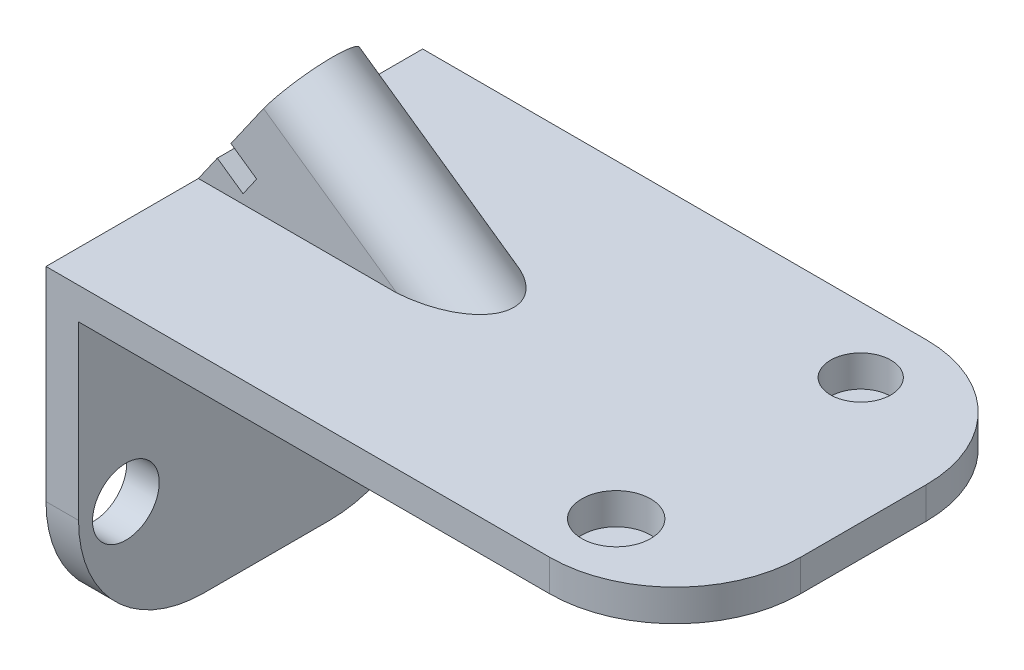
ISO-10303-21;
HEADER;
FILE_DESCRIPTION(('STEP AP214'),'2;1');
FILE_NAME('part.step','',(''),(''),'','','');
FILE_SCHEMA(('AUTOMOTIVE_DESIGN { 1 0 10303 214 1 1 1 1 }'));
ENDSEC;
DATA;
#1=APPLICATION_CONTEXT('core data for automotive mechanical design processes');
#2=APPLICATION_PROTOCOL_DEFINITION('international standard','automotive_design',2000,#1);
#3=PRODUCT_CONTEXT('',#1,'mechanical');
#4=PRODUCT('Part','Part','',(#3));
#5=PRODUCT_RELATED_PRODUCT_CATEGORY('part','',(#4));
#6=PRODUCT_DEFINITION_FORMATION('','',#4);
#7=PRODUCT_DEFINITION_CONTEXT('part definition',#1,'design');
#8=PRODUCT_DEFINITION('design','',#6,#7);
#9=PRODUCT_DEFINITION_SHAPE('','',#8);
#10=(LENGTH_UNIT() NAMED_UNIT(*) SI_UNIT(.MILLI.,.METRE.));
#11=(NAMED_UNIT(*) PLANE_ANGLE_UNIT() SI_UNIT($,.RADIAN.));
#12=(NAMED_UNIT(*) SI_UNIT($,.STERADIAN.) SOLID_ANGLE_UNIT());
#13=UNCERTAINTY_MEASURE_WITH_UNIT(LENGTH_MEASURE(1.E-05),#10,'distance_accuracy_value','');
#14=(GEOMETRIC_REPRESENTATION_CONTEXT(3) GLOBAL_UNCERTAINTY_ASSIGNED_CONTEXT((#13)) GLOBAL_UNIT_ASSIGNED_CONTEXT((#10,
#11,#12)) REPRESENTATION_CONTEXT('',''));
#15=CARTESIAN_POINT('',(0.,0.,0.));
#16=DIRECTION('',(0.,0.,1.));
#17=DIRECTION('',(1.,0.,0.));
#18=AXIS2_PLACEMENT_3D('',#15,#16,#17);
#19=CARTESIAN_POINT('',(-38.9542038600132,27.2362726175702,-50.));
#20=DIRECTION('',(-0.819544823722907,0.573015080001382,0.));
#21=DIRECTION('',(-0.573015080001382,-0.819544823722907,0.));
#22=AXIS2_PLACEMENT_3D('',#19,#20,#21);
#23=PLANE('',#22);
#24=CARTESIAN_POINT('',(-31.2198983618123,38.2981281556948,-23.1969128920143));
#25=DIRECTION('',(-0.819544823722907,0.573015080001382,0.));
#26=DIRECTION('',(-0.573015080001382,-0.819544823722907,0.));
#27=AXIS2_PLACEMENT_3D('',#24,#25,#26);
#28=CIRCLE('',#27,6.13363539103106);
#29=CARTESIAN_POINT('',(-34.7345639361033,33.2713390203717,-23.1969128920143));
#30=VERTEX_POINT('',#29);
#31=EDGE_CURVE('E371',#30,#30,#28,.T.);
#32=ORIENTED_EDGE('',*,*,#31,.F.);
#33=EDGE_LOOP('',(#32));
#34=FACE_BOUND('',#33,.T.);
#35=DIRECTION('',(0.,0.,-1.));
#36=VECTOR('',#35,1.);
#37=CARTESIAN_POINT('',(-40.5606897132775,24.9386242460411,-37.8469956443982));
#38=LINE('',#37,#36);
#39=CARTESIAN_POINT('',(-40.5606897132775,24.9386242460411,-8.54683013963037));
#40=VERTEX_POINT('',#39);
#41=CARTESIAN_POINT('',(-40.5606897132775,24.9386242460411,-37.8469956443982));
#42=VERTEX_POINT('',#41);
#43=EDGE_CURVE('E188',#40,#42,#38,.T.);
#44=ORIENTED_EDGE('',*,*,#43,.F.);
#45=DIRECTION('',(-0.573015080001382,-0.819544823722907,0.));
#46=VECTOR('',#45,1.);
#47=CARTESIAN_POINT('',(-38.9542038600132,27.2362726175702,-8.54683013963037));
#48=LINE('',#47,#46);
#49=CARTESIAN_POINT('',(-30.182865196379,39.781326752768,-8.54683013963037));
#50=VERTEX_POINT('',#49);
#51=EDGE_CURVE('E259',#50,#40,#48,.T.);
#52=ORIENTED_EDGE('',*,*,#51,.F.);
#53=CARTESIAN_POINT('',(-31.2198983618123,38.2981281556948,-23.1969128920143));
#54=DIRECTION('',(-0.819544823722907,0.573015080001382,0.));
#55=DIRECTION('',(-0.573015080001382,-0.819544823722907,0.));
#56=AXIS2_PLACEMENT_3D('',#53,#54,#55);
#57=CIRCLE('',#56,14.7614443912601);
#58=CARTESIAN_POINT('',(-30.182865196379,39.781326752768,-37.8469956443982));
#59=VERTEX_POINT('',#58);
#60=EDGE_CURVE('E255',#59,#50,#57,.F.);
#61=ORIENTED_EDGE('',*,*,#60,.F.);
#62=DIRECTION('',(-0.573015080001382,-0.819544823722907,0.));
#63=VECTOR('',#62,1.);
#64=CARTESIAN_POINT('',(-38.9542038600132,27.2362726175702,-37.8469956443982));
#65=LINE('',#64,#63);
#66=EDGE_CURVE('E263',#59,#42,#65,.T.);
#67=ORIENTED_EDGE('',*,*,#66,.T.);
#68=EDGE_LOOP('',(#44,#52,#61,#67));
#69=FACE_BOUND('',#68,.T.);
#70=ADVANCED_FACE('F41',(#34,#69),#23,.T.);
#71=DIRECTION('',(0.,0.,1.));
#72=VECTOR('',#71,1.);
#73=CARTESIAN_POINT('',(-44.9050178383504,18.7252247183206,-37.8469956443982));
#74=LINE('',#73,#72);
#75=CARTESIAN_POINT('',(-44.9050178383504,18.7252247183206,-37.8469956443982));
#76=VERTEX_POINT('',#75);
#77=CARTESIAN_POINT('',(-44.9050178383504,18.7252247183206,-8.54683013963037));
#78=VERTEX_POINT('',#77);
#79=EDGE_CURVE('E356',#76,#78,#74,.T.);
#80=ORIENTED_EDGE('',*,*,#79,.F.);
#81=CARTESIAN_POINT('',(-50.938514230176,10.0959217393142,-37.8469956443982));
#82=VERTEX_POINT('',#81);
#83=EDGE_CURVE('E193',#76,#82,#65,.T.);
#84=ORIENTED_EDGE('',*,*,#83,.T.);
#85=DIRECTION('',(0.,0.,1.));
#86=VECTOR('',#85,1.);
#87=CARTESIAN_POINT('',(-50.938514230176,10.0959217393142,-50.));
#88=LINE('',#87,#86);
#89=CARTESIAN_POINT('',(-50.938514230176,10.0959217393142,-8.54683013963037));
#90=VERTEX_POINT('',#89);
#91=EDGE_CURVE('E285',#82,#90,#88,.T.);
#92=ORIENTED_EDGE('',*,*,#91,.T.);
#93=EDGE_CURVE('E258',#78,#90,#48,.T.);
#94=ORIENTED_EDGE('',*,*,#93,.F.);
#95=EDGE_LOOP('',(#80,#84,#92,#94));
#96=FACE_BOUND('',#95,.T.);
#97=ADVANCED_FACE('F412',(#96),#23,.T.);
#98=CARTESIAN_POINT('',(50.7345840104783,-19.0033798444434,-23.1969128920143));
#99=DIRECTION('',(-0.819544823722906,0.573015080001382,0.));
#100=DIRECTION('',(-0.573015080001382,-0.819544823722907,0.));
#101=AXIS2_PLACEMENT_3D('',#98,#99,#100);
#102=CYLINDRICAL_SURFACE('',#101,14.7614443912601);
#103=DIRECTION('',(-0.819544823722906,0.573015080001382,0.));
#104=VECTOR('',#103,1.);
#105=CARTESIAN_POINT('',(51.7716171759116,-17.5201812473702,-37.8469956443982));
#106=LINE('',#105,#104);
#107=CARTESIAN_POINT('',(12.2741675554212,10.0959217393142,-37.8469956443982));
#108=VERTEX_POINT('',#107);
#109=EDGE_CURVE('E268',#108,#59,#106,.T.);
#110=ORIENTED_EDGE('',*,*,#109,.T.);
#111=ORIENTED_EDGE('',*,*,#60,.T.);
#112=DIRECTION('',(-0.819544823722906,0.573015080001382,0.));
#113=VECTOR('',#112,1.);
#114=CARTESIAN_POINT('',(51.7716171759116,-17.5201812473702,-8.54683013963037));
#115=LINE('',#114,#113);
#116=CARTESIAN_POINT('',(12.2741675554212,10.0959217393142,-8.54683013963037));
#117=VERTEX_POINT('',#116);
#118=EDGE_CURVE('E267',#117,#50,#115,.T.);
#119=ORIENTED_EDGE('',*,*,#118,.F.);
#120=CARTESIAN_POINT('',(9.11581546626697,10.0959217393142,-23.1969128920143));
#121=DIRECTION('',(0.,1.,0.));
#122=DIRECTION('',(-1.,0.,0.));
#123=AXIS2_PLACEMENT_3D('',#120,#121,#122);
#124=ELLIPSE('',#123,25.7610050877274,14.7614443912601);
#125=EDGE_CURVE('E281',#108,#117,#124,.F.);
#126=ORIENTED_EDGE('',*,*,#125,.F.);
#127=EDGE_LOOP('',(#110,#111,#119,#126));
#128=FACE_BOUND('',#127,.T.);
#129=ADVANCED_FACE('F396',(#128),#102,.T.);
#130=CARTESIAN_POINT('',(43.0002785122774,-30.0652353825679,-37.8469956443982));
#131=DIRECTION('',(0.,0.,-1.));
#132=DIRECTION('',(-1.,0.,0.));
#133=AXIS2_PLACEMENT_3D('',#130,#131,#132);
#134=PLANE('',#133);
#135=DIRECTION('',(-0.819544823722906,0.573015080001382,0.));
#136=VECTOR('',#135,1.);
#137=CARTESIAN_POINT('',(-32.3652414760485,19.2084734460272,-37.8469956443982));
#138=LINE('',#137,#136);
#139=CARTESIAN_POINT('',(-32.3652414760485,19.2084734460272,-37.8469956443982));
#140=VERTEX_POINT('',#139);
#141=EDGE_CURVE('E374',#140,#42,#138,.T.);
#142=ORIENTED_EDGE('',*,*,#141,.T.);
#143=ORIENTED_EDGE('',*,*,#66,.F.);
#144=ORIENTED_EDGE('',*,*,#109,.F.);
#145=DIRECTION('',(-1.,0.,0.));
#146=VECTOR('',#145,1.);
#147=CARTESIAN_POINT('',(0.,10.0959217393142,-37.8469956443982));
#148=LINE('',#147,#146);
#149=EDGE_CURVE('E278',#108,#82,#148,.T.);
#150=ORIENTED_EDGE('',*,*,#149,.T.);
#151=ORIENTED_EDGE('',*,*,#83,.F.);
#152=DIRECTION('',(-0.819544823722906,0.573015080001382,0.));
#153=VECTOR('',#152,1.);
#154=CARTESIAN_POINT('',(-36.7095696011213,12.9950739183068,-37.8469956443982));
#155=LINE('',#154,#153);
#156=CARTESIAN_POINT('',(-36.7095696011213,12.9950739183068,-37.8469956443982));
#157=VERTEX_POINT('',#156);
#158=EDGE_CURVE('E170',#157,#76,#155,.T.);
#159=ORIENTED_EDGE('',*,*,#158,.F.);
#160=DIRECTION('',(-0.573015080001382,-0.819544823722907,0.));
#161=VECTOR('',#160,1.);
#162=CARTESIAN_POINT('',(-32.3652414760485,19.2084734460272,-37.8469956443982));
#163=LINE('',#162,#161);
#164=EDGE_CURVE('E178',#140,#157,#163,.T.);
#165=ORIENTED_EDGE('',*,*,#164,.F.);
#166=EDGE_LOOP('',(#142,#143,#144,#150,#151,#159,#165));
#167=FACE_BOUND('',#166,.T.);
#168=ADVANCED_FACE('F191',(#167),#134,.T.);
#169=CARTESIAN_POINT('',(43.0002785122774,-30.0652353825679,-8.54683013963037));
#170=DIRECTION('',(0.,0.,-1.));
#171=DIRECTION('',(0.,1.,0.));
#172=AXIS2_PLACEMENT_3D('',#169,#170,#171);
#173=PLANE('',#172);
#174=ORIENTED_EDGE('',*,*,#51,.T.);
#175=DIRECTION('',(-0.819544823722906,0.573015080001382,0.));
#176=VECTOR('',#175,1.);
#177=CARTESIAN_POINT('',(-32.3652414760485,19.2084734460272,-8.54683013963037));
#178=LINE('',#177,#176);
#179=CARTESIAN_POINT('',(-32.3652414760485,19.2084734460272,-8.54683013963037));
#180=VERTEX_POINT('',#179);
#181=EDGE_CURVE('E198',#180,#40,#178,.T.);
#182=ORIENTED_EDGE('',*,*,#181,.F.);
#183=DIRECTION('',(0.573015080001382,0.819544823722907,0.));
#184=VECTOR('',#183,1.);
#185=CARTESIAN_POINT('',(-32.3652414760485,19.2084734460272,-8.54683013963037));
#186=LINE('',#185,#184);
#187=CARTESIAN_POINT('',(-36.7095696011214,12.9950739183068,-8.54683013963037));
#188=VERTEX_POINT('',#187);
#189=EDGE_CURVE('E177',#188,#180,#186,.T.);
#190=ORIENTED_EDGE('',*,*,#189,.F.);
#191=DIRECTION('',(-0.819544823722906,0.573015080001382,0.));
#192=VECTOR('',#191,1.);
#193=CARTESIAN_POINT('',(-36.7095696011213,12.9950739183068,-8.54683013963037));
#194=LINE('',#193,#192);
#195=EDGE_CURVE('E173',#188,#78,#194,.T.);
#196=ORIENTED_EDGE('',*,*,#195,.T.);
#197=ORIENTED_EDGE('',*,*,#93,.T.);
#198=DIRECTION('',(-1.,0.,0.));
#199=VECTOR('',#198,1.);
#200=CARTESIAN_POINT('',(0.,10.0959217393142,-8.54683013963037));
#201=LINE('',#200,#199);
#202=EDGE_CURVE('E271',#117,#90,#201,.T.);
#203=ORIENTED_EDGE('',*,*,#202,.F.);
#204=ORIENTED_EDGE('',*,*,#118,.T.);
#205=EDGE_LOOP('',(#174,#182,#190,#196,#197,#203,#204));
#206=FACE_BOUND('',#205,.T.);
#207=ADVANCED_FACE('F393',(#206),#173,.F.);
#208=CARTESIAN_POINT('',(149.486050834949,0.,40.));
#209=DIRECTION('',(-1.,0.,0.));
#210=DIRECTION('',(0.,0.,1.));
#211=AXIS2_PLACEMENT_3D('',#208,#209,#210);
#212=PLANE('',#211);
#213=DIRECTION('',(0.,0.,-1.));
#214=VECTOR('',#213,1.);
#215=CARTESIAN_POINT('',(149.486050834949,0.,40.));
#216=LINE('',#215,#214);
#217=CARTESIAN_POINT('',(149.486050834949,0.,0.));
#218=VERTEX_POINT('',#217);
#219=CARTESIAN_POINT('',(149.486050834949,0.,-40.));
#220=VERTEX_POINT('',#219);
#221=EDGE_CURVE('E230',#218,#220,#216,.T.);
#222=ORIENTED_EDGE('',*,*,#221,.T.);
#223=DIRECTION('',(0.,1.,0.));
#224=VECTOR('',#223,1.);
#225=CARTESIAN_POINT('',(149.486050834949,0.,-40.));
#226=LINE('',#225,#224);
#227=CARTESIAN_POINT('',(149.486050834949,10.0959217393142,-40.));
#228=VERTEX_POINT('',#227);
#229=EDGE_CURVE('E318',#220,#228,#226,.T.);
#230=ORIENTED_EDGE('',*,*,#229,.T.);
#231=DIRECTION('',(0.,0.,-1.));
#232=VECTOR('',#231,1.);
#233=CARTESIAN_POINT('',(149.486050834949,10.0959217393142,40.));
#234=LINE('',#233,#232);
#235=CARTESIAN_POINT('',(149.486050834949,10.0959217393142,0.));
#236=VERTEX_POINT('',#235);
#237=EDGE_CURVE('E251',#236,#228,#234,.T.);
#238=ORIENTED_EDGE('',*,*,#237,.F.);
#239=DIRECTION('',(0.,1.,0.));
#240=VECTOR('',#239,1.);
#241=CARTESIAN_POINT('',(149.486050834949,0.,0.));
#242=LINE('',#241,#240);
#243=EDGE_CURVE('E315',#236,#218,#242,.F.);
#244=ORIENTED_EDGE('',*,*,#243,.T.);
#245=EDGE_LOOP('',(#222,#230,#238,#244));
#246=FACE_BOUND('',#245,.T.);
#247=ADVANCED_FACE('F445',(#246),#212,.F.);
#248=CARTESIAN_POINT('',(149.486050834949,10.0959217393142,40.));
#249=DIRECTION('',(0.,-1.,0.));
#250=DIRECTION('',(1.,0.,0.));
#251=AXIS2_PLACEMENT_3D('',#248,#249,#250);
#252=PLANE('',#251);
#253=CARTESIAN_POINT('',(109.486050834949,10.0959217393142,-59.1371422561504));
#254=DIRECTION('',(0.,1.,0.));
#255=DIRECTION('',(-1.,0.,0.));
#256=AXIS2_PLACEMENT_3D('',#253,#254,#255);
#257=CIRCLE('',#256,9.61262759646853);
#258=CARTESIAN_POINT('',(99.8734232384804,10.0959217393142,-59.1371422561504));
#259=VERTEX_POINT('',#258);
#260=EDGE_CURVE('E357',#259,#259,#257,.T.);
#261=ORIENTED_EDGE('',*,*,#260,.F.);
#262=EDGE_LOOP('',(#261));
#263=FACE_BOUND('',#262,.T.);
#264=CARTESIAN_POINT('',(109.486050834949,10.0959217393142,18.771374571513));
#265=DIRECTION('',(0.,1.,0.));
#266=DIRECTION('',(-1.,0.,0.));
#267=AXIS2_PLACEMENT_3D('',#264,#265,#266);
#268=CIRCLE('',#267,10.9785923391769);
#269=CARTESIAN_POINT('',(98.5074584957721,10.0959217393142,18.771374571513));
#270=VERTEX_POINT('',#269);
#271=EDGE_CURVE('E342',#270,#270,#268,.T.);
#272=ORIENTED_EDGE('',*,*,#271,.F.);
#273=EDGE_LOOP('',(#272));
#274=FACE_BOUND('',#273,.T.);
#275=ORIENTED_EDGE('',*,*,#237,.T.);
#276=CARTESIAN_POINT('',(109.486050834949,10.0959217393142,-40.));
#277=DIRECTION('',(0.,-1.,0.));
#278=DIRECTION('',(1.,0.,0.));
#279=AXIS2_PLACEMENT_3D('',#276,#277,#278);
#280=CIRCLE('',#279,40.);
#281=CARTESIAN_POINT('',(109.486050834949,10.0959217393142,-80.));
#282=VERTEX_POINT('',#281);
#283=EDGE_CURVE('E325',#228,#282,#280,.F.);
#284=ORIENTED_EDGE('',*,*,#283,.T.);
#285=DIRECTION('',(-1.,0.,0.));
#286=VECTOR('',#285,1.);
#287=CARTESIAN_POINT('',(149.486050834949,10.0959217393142,-80.));
#288=LINE('',#287,#286);
#289=CARTESIAN_POINT('',(-50.938514230176,10.0959217393142,-80.));
#290=VERTEX_POINT('',#289);
#291=EDGE_CURVE('E203',#282,#290,#288,.T.);
#292=ORIENTED_EDGE('',*,*,#291,.T.);
#293=DIRECTION('',(0.,0.,-1.));
#294=VECTOR('',#293,1.);
#295=CARTESIAN_POINT('',(-50.938514230176,10.0959217393142,40.));
#296=LINE('',#295,#294);
#297=EDGE_CURVE('E246',#82,#290,#296,.T.);
#298=ORIENTED_EDGE('',*,*,#297,.F.);
#299=ORIENTED_EDGE('',*,*,#149,.F.);
#300=ORIENTED_EDGE('',*,*,#125,.T.);
#301=ORIENTED_EDGE('',*,*,#202,.T.);
#302=CARTESIAN_POINT('',(-50.938514230176,10.0959217393142,40.));
#303=VERTEX_POINT('',#302);
#304=EDGE_CURVE('E247',#303,#90,#296,.T.);
#305=ORIENTED_EDGE('',*,*,#304,.F.);
#306=DIRECTION('',(-1.,0.,0.));
#307=VECTOR('',#306,1.);
#308=CARTESIAN_POINT('',(149.486050834949,10.0959217393142,40.));
#309=LINE('',#308,#307);
#310=CARTESIAN_POINT('',(109.486050834949,10.0959217393142,40.));
#311=VERTEX_POINT('',#310);
#312=EDGE_CURVE('E217',#311,#303,#309,.T.);
#313=ORIENTED_EDGE('',*,*,#312,.F.);
#314=CARTESIAN_POINT('',(109.486050834949,10.0959217393142,0.));
#315=DIRECTION('',(0.,-1.,0.));
#316=DIRECTION('',(1.,0.,0.));
#317=AXIS2_PLACEMENT_3D('',#314,#315,#316);
#318=CIRCLE('',#317,40.);
#319=EDGE_CURVE('E322',#311,#236,#318,.F.);
#320=ORIENTED_EDGE('',*,*,#319,.T.);
#321=EDGE_LOOP('',(#275,#284,#292,#298,#299,#300,#301,#305,#313,#320));
#322=FACE_BOUND('',#321,.T.);
#323=ADVANCED_FACE('F400',(#263,#274,#322),#252,.F.);
#324=CARTESIAN_POINT('',(-50.938514230176,10.0959217393142,40.));
#325=DIRECTION('',(1.,0.,0.));
#326=DIRECTION('',(0.,0.,-1.));
#327=AXIS2_PLACEMENT_3D('',#324,#325,#326);
#328=PLANE('',#327);
#329=CARTESIAN_POINT('',(-50.938514230176,-57.1640659984027,-63.5436924796393));
#330=DIRECTION('',(-1.,0.,0.));
#331=DIRECTION('',(0.,0.,1.));
#332=AXIS2_PLACEMENT_3D('',#329,#330,#331);
#333=CIRCLE('',#332,10.6287753296757);
#334=CARTESIAN_POINT('',(-50.938514230176,-57.1640659984027,-52.9149171499635));
#335=VERTEX_POINT('',#334);
#336=EDGE_CURVE('E336',#335,#335,#333,.T.);
#337=ORIENTED_EDGE('',*,*,#336,.F.);
#338=EDGE_LOOP('',(#337));
#339=FACE_BOUND('',#338,.T.);
#340=CARTESIAN_POINT('',(-50.938514230176,-57.1640659984027,24.9151473608878));
#341=DIRECTION('',(-1.,0.,0.));
#342=DIRECTION('',(0.,0.,1.));
#343=AXIS2_PLACEMENT_3D('',#340,#341,#342);
#344=CIRCLE('',#343,10.6287753296757);
#345=CARTESIAN_POINT('',(-50.938514230176,-57.1640659984027,35.5439226905635));
#346=VERTEX_POINT('',#345);
#347=EDGE_CURVE('E344',#346,#346,#344,.T.);
#348=ORIENTED_EDGE('',*,*,#347,.F.);
#349=EDGE_LOOP('',(#348));
#350=FACE_BOUND('',#349,.T.);
#351=DIRECTION('',(0.,-1.,0.));
#352=VECTOR('',#351,1.);
#353=CARTESIAN_POINT('',(-50.938514230176,10.0959217393142,-80.));
#354=LINE('',#353,#352);
#355=CARTESIAN_POINT('',(-50.938514230176,-54.7797265503599,-80.));
#356=VERTEX_POINT('',#355);
#357=EDGE_CURVE('E206',#290,#356,#354,.T.);
#358=ORIENTED_EDGE('',*,*,#357,.T.);
#359=CARTESIAN_POINT('',(-50.938514230176,-54.7797265503599,-40.));
#360=DIRECTION('',(1.,0.,0.));
#361=DIRECTION('',(0.,0.,-1.));
#362=AXIS2_PLACEMENT_3D('',#359,#360,#361);
#363=CIRCLE('',#362,40.);
#364=CARTESIAN_POINT('',(-50.938514230176,-94.77972655036,-40.));
#365=VERTEX_POINT('',#364);
#366=EDGE_CURVE('E308',#356,#365,#363,.F.);
#367=ORIENTED_EDGE('',*,*,#366,.T.);
#368=DIRECTION('',(0.,0.,-1.));
#369=VECTOR('',#368,1.);
#370=CARTESIAN_POINT('',(-50.938514230176,-94.77972655036,40.));
#371=LINE('',#370,#369);
#372=CARTESIAN_POINT('',(-50.938514230176,-94.77972655036,0.));
#373=VERTEX_POINT('',#372);
#374=EDGE_CURVE('E242',#373,#365,#371,.T.);
#375=ORIENTED_EDGE('',*,*,#374,.F.);
#376=CARTESIAN_POINT('',(-50.938514230176,-54.7797265503599,0.));
#377=DIRECTION('',(1.,0.,0.));
#378=DIRECTION('',(0.,0.,-1.));
#379=AXIS2_PLACEMENT_3D('',#376,#377,#378);
#380=CIRCLE('',#379,40.);
#381=CARTESIAN_POINT('',(-50.938514230176,-54.7797265503599,40.));
#382=VERTEX_POINT('',#381);
#383=EDGE_CURVE('E305',#373,#382,#380,.F.);
#384=ORIENTED_EDGE('',*,*,#383,.T.);
#385=DIRECTION('',(0.,-1.,0.));
#386=VECTOR('',#385,1.);
#387=CARTESIAN_POINT('',(-50.938514230176,10.0959217393142,40.));
#388=LINE('',#387,#386);
#389=EDGE_CURVE('E220',#303,#382,#388,.T.);
#390=ORIENTED_EDGE('',*,*,#389,.F.);
#391=ORIENTED_EDGE('',*,*,#304,.T.);
#392=ORIENTED_EDGE('',*,*,#91,.F.);
#393=ORIENTED_EDGE('',*,*,#297,.T.);
#394=EDGE_LOOP('',(#358,#367,#375,#384,#390,#391,#392,#393));
#395=FACE_BOUND('',#394,.T.);
#396=ADVANCED_FACE('F408',(#339,#350,#395),#328,.F.);
#397=CARTESIAN_POINT('',(-50.938514230176,-94.77972655036,40.));
#398=DIRECTION('',(0.,1.,0.));
#399=DIRECTION('',(0.,0.,1.));
#400=AXIS2_PLACEMENT_3D('',#397,#398,#399);
#401=PLANE('',#400);
#402=ORIENTED_EDGE('',*,*,#374,.T.);
#403=DIRECTION('',(1.,0.,0.));
#404=VECTOR('',#403,1.);
#405=CARTESIAN_POINT('',(-50.938514230176,-94.77972655036,-40.));
#406=LINE('',#405,#404);
#407=CARTESIAN_POINT('',(-40.5773130530093,-94.77972655036,-40.));
#408=VERTEX_POINT('',#407);
#409=EDGE_CURVE('E292',#365,#408,#406,.T.);
#410=ORIENTED_EDGE('',*,*,#409,.T.);
#411=DIRECTION('',(0.,0.,-1.));
#412=VECTOR('',#411,1.);
#413=CARTESIAN_POINT('',(-40.5773130530093,-94.77972655036,40.));
#414=LINE('',#413,#412);
#415=CARTESIAN_POINT('',(-40.5773130530093,-94.77972655036,0.));
#416=VERTEX_POINT('',#415);
#417=EDGE_CURVE('E238',#416,#408,#414,.T.);
#418=ORIENTED_EDGE('',*,*,#417,.F.);
#419=DIRECTION('',(1.,0.,0.));
#420=VECTOR('',#419,1.);
#421=CARTESIAN_POINT('',(-50.938514230176,-94.77972655036,0.));
#422=LINE('',#421,#420);
#423=EDGE_CURVE('E289',#416,#373,#422,.F.);
#424=ORIENTED_EDGE('',*,*,#423,.T.);
#425=EDGE_LOOP('',(#402,#410,#418,#424));
#426=FACE_BOUND('',#425,.T.);
#427=ADVANCED_FACE('F462',(#426),#401,.F.);
#428=CARTESIAN_POINT('',(-40.5773130530093,-94.77972655036,40.));
#429=DIRECTION('',(-1.,0.,0.));
#430=DIRECTION('',(0.,0.,1.));
#431=AXIS2_PLACEMENT_3D('',#428,#429,#430);
#432=PLANE('',#431);
#433=CARTESIAN_POINT('',(-40.5773130530093,-57.1640659984027,-63.5436924796393));
#434=DIRECTION('',(-1.,0.,0.));
#435=DIRECTION('',(0.,0.,1.));
#436=AXIS2_PLACEMENT_3D('',#433,#434,#435);
#437=CIRCLE('',#436,10.6287753296757);
#438=CARTESIAN_POINT('',(-40.5773130530093,-57.1640659984027,-52.9149171499635));
#439=VERTEX_POINT('',#438);
#440=EDGE_CURVE('E45',#439,#439,#437,.T.);
#441=ORIENTED_EDGE('',*,*,#440,.T.);
#442=EDGE_LOOP('',(#441));
#443=FACE_BOUND('',#442,.T.);
#444=CARTESIAN_POINT('',(-40.5773130530093,-57.1640659984027,24.9151473608878));
#445=DIRECTION('',(-1.,0.,0.));
#446=DIRECTION('',(0.,0.,1.));
#447=AXIS2_PLACEMENT_3D('',#444,#445,#446);
#448=CIRCLE('',#447,10.6287753296757);
#449=CARTESIAN_POINT('',(-40.5773130530093,-57.1640659984027,35.5439226905635));
#450=VERTEX_POINT('',#449);
#451=EDGE_CURVE('E333',#450,#450,#448,.T.);
#452=ORIENTED_EDGE('',*,*,#451,.T.);
#453=EDGE_LOOP('',(#452));
#454=FACE_BOUND('',#453,.T.);
#455=ORIENTED_EDGE('',*,*,#417,.T.);
#456=CARTESIAN_POINT('',(-40.5773130530093,-54.7797265503599,-40.));
#457=DIRECTION('',(-1.,0.,0.));
#458=DIRECTION('',(0.,0.,1.));
#459=AXIS2_PLACEMENT_3D('',#456,#457,#458);
#460=CIRCLE('',#459,40.);
#461=CARTESIAN_POINT('',(-40.5773130530093,-54.77972655036,-80.));
#462=VERTEX_POINT('',#461);
#463=EDGE_CURVE('E299',#408,#462,#460,.F.);
#464=ORIENTED_EDGE('',*,*,#463,.T.);
#465=DIRECTION('',(0.,1.,0.));
#466=VECTOR('',#465,1.);
#467=CARTESIAN_POINT('',(-40.5773130530093,-94.77972655036,-80.));
#468=LINE('',#467,#466);
#469=CARTESIAN_POINT('',(-40.5773130530093,0.,-80.));
#470=VERTEX_POINT('',#469);
#471=EDGE_CURVE('E211',#462,#470,#468,.T.);
#472=ORIENTED_EDGE('',*,*,#471,.T.);
#473=DIRECTION('',(0.,0.,-1.));
#474=VECTOR('',#473,1.);
#475=CARTESIAN_POINT('',(-40.5773130530093,0.,40.));
#476=LINE('',#475,#474);
#477=CARTESIAN_POINT('',(-40.5773130530093,0.,40.));
#478=VERTEX_POINT('',#477);
#479=EDGE_CURVE('E234',#478,#470,#476,.T.);
#480=ORIENTED_EDGE('',*,*,#479,.F.);
#481=DIRECTION('',(0.,1.,0.));
#482=VECTOR('',#481,1.);
#483=CARTESIAN_POINT('',(-40.5773130530093,-94.77972655036,40.));
#484=LINE('',#483,#482);
#485=CARTESIAN_POINT('',(-40.5773130530093,-54.77972655036,40.));
#486=VERTEX_POINT('',#485);
#487=EDGE_CURVE('E224',#486,#478,#484,.T.);
#488=ORIENTED_EDGE('',*,*,#487,.F.);
#489=CARTESIAN_POINT('',(-40.5773130530093,-54.7797265503599,0.));
#490=DIRECTION('',(-1.,0.,0.));
#491=DIRECTION('',(0.,0.,1.));
#492=AXIS2_PLACEMENT_3D('',#489,#490,#491);
#493=CIRCLE('',#492,40.);
#494=EDGE_CURVE('E296',#486,#416,#493,.F.);
#495=ORIENTED_EDGE('',*,*,#494,.T.);
#496=EDGE_LOOP('',(#455,#464,#472,#480,#488,#495));
#497=FACE_BOUND('',#496,.T.);
#498=ADVANCED_FACE('F459',(#443,#454,#497),#432,.F.);
#499=CARTESIAN_POINT('',(-40.5773130530093,0.,40.));
#500=DIRECTION('',(0.,1.,0.));
#501=DIRECTION('',(0.,0.,1.));
#502=AXIS2_PLACEMENT_3D('',#499,#500,#501);
#503=PLANE('',#502);
#504=DIRECTION('',(1.,0.,0.));
#505=VECTOR('',#504,1.);
#506=CARTESIAN_POINT('',(-40.5773130530093,0.,-80.));
#507=LINE('',#506,#505);
#508=CARTESIAN_POINT('',(109.486050834949,0.,-80.));
#509=VERTEX_POINT('',#508);
#510=EDGE_CURVE('E214',#470,#509,#507,.T.);
#511=ORIENTED_EDGE('',*,*,#510,.T.);
#512=CARTESIAN_POINT('',(109.486050834949,0.,-40.));
#513=DIRECTION('',(0.,1.,0.));
#514=DIRECTION('',(0.,0.,1.));
#515=AXIS2_PLACEMENT_3D('',#512,#513,#514);
#516=CIRCLE('',#515,40.);
#517=EDGE_CURVE('E51',#509,#220,#516,.F.);
#518=ORIENTED_EDGE('',*,*,#517,.T.);
#519=ORIENTED_EDGE('',*,*,#221,.F.);
#520=CARTESIAN_POINT('',(109.486050834949,0.,0.));
#521=DIRECTION('',(0.,1.,0.));
#522=DIRECTION('',(0.,0.,1.));
#523=AXIS2_PLACEMENT_3D('',#520,#521,#522);
#524=CIRCLE('',#523,40.);
#525=CARTESIAN_POINT('',(109.486050834949,0.,40.));
#526=VERTEX_POINT('',#525);
#527=EDGE_CURVE('E59',#218,#526,#524,.F.);
#528=ORIENTED_EDGE('',*,*,#527,.T.);
#529=DIRECTION('',(1.,0.,0.));
#530=VECTOR('',#529,1.);
#531=CARTESIAN_POINT('',(-40.5773130530093,0.,40.));
#532=LINE('',#531,#530);
#533=EDGE_CURVE('E227',#478,#526,#532,.T.);
#534=ORIENTED_EDGE('',*,*,#533,.F.);
#535=ORIENTED_EDGE('',*,*,#479,.T.);
#536=EDGE_LOOP('',(#511,#518,#519,#528,#534,#535));
#537=FACE_BOUND('',#536,.T.);
#538=ADVANCED_FACE('F443',(#537),#503,.F.);
#539=CARTESIAN_POINT('',(0.,0.,40.));
#540=DIRECTION('',(0.,0.,1.));
#541=DIRECTION('',(1.,0.,0.));
#542=AXIS2_PLACEMENT_3D('',#539,#540,#541);
#543=PLANE('',#542);
#544=ORIENTED_EDGE('',*,*,#533,.T.);
#545=DIRECTION('',(0.,1.,0.));
#546=VECTOR('',#545,1.);
#547=CARTESIAN_POINT('',(109.486050834949,10.0959217393142,40.));
#548=LINE('',#547,#546);
#549=EDGE_CURVE('E11',#526,#311,#548,.T.);
#550=ORIENTED_EDGE('',*,*,#549,.T.);
#551=ORIENTED_EDGE('',*,*,#312,.T.);
#552=ORIENTED_EDGE('',*,*,#389,.T.);
#553=DIRECTION('',(1.,0.,0.));
#554=VECTOR('',#553,1.);
#555=CARTESIAN_POINT('',(-40.5773130530093,-54.7797265503599,40.));
#556=LINE('',#555,#554);
#557=EDGE_CURVE('E311',#382,#486,#556,.T.);
#558=ORIENTED_EDGE('',*,*,#557,.T.);
#559=ORIENTED_EDGE('',*,*,#487,.T.);
#560=EDGE_LOOP('',(#544,#550,#551,#552,#558,#559));
#561=FACE_BOUND('',#560,.T.);
#562=ADVANCED_FACE('F451',(#561),#543,.T.);
#563=CARTESIAN_POINT('',(0.,0.,-80.));
#564=DIRECTION('',(0.,0.,1.));
#565=DIRECTION('',(1.,0.,0.));
#566=AXIS2_PLACEMENT_3D('',#563,#564,#565);
#567=PLANE('',#566);
#568=ORIENTED_EDGE('',*,*,#291,.F.);
#569=DIRECTION('',(0.,1.,0.));
#570=VECTOR('',#569,1.);
#571=CARTESIAN_POINT('',(109.486050834949,0.,-80.));
#572=LINE('',#571,#570);
#573=EDGE_CURVE('E67',#282,#509,#572,.F.);
#574=ORIENTED_EDGE('',*,*,#573,.T.);
#575=ORIENTED_EDGE('',*,*,#510,.F.);
#576=ORIENTED_EDGE('',*,*,#471,.F.);
#577=DIRECTION('',(1.,0.,0.));
#578=VECTOR('',#577,1.);
#579=CARTESIAN_POINT('',(0.,-54.7797265503599,-80.));
#580=LINE('',#579,#578);
#581=EDGE_CURVE('E302',#462,#356,#580,.F.);
#582=ORIENTED_EDGE('',*,*,#581,.T.);
#583=ORIENTED_EDGE('',*,*,#357,.F.);
#584=EDGE_LOOP('',(#568,#574,#575,#576,#582,#583));
#585=FACE_BOUND('',#584,.T.);
#586=ADVANCED_FACE('F467',(#585),#567,.F.);
#587=CARTESIAN_POINT('',(-32.3652414760485,19.2084734460272,-37.8469956443982));
#588=DIRECTION('',(0.573015080001382,0.819544823722906,0.));
#589=DIRECTION('',(-0.819544823722907,0.573015080001382,0.));
#590=AXIS2_PLACEMENT_3D('',#587,#588,#589);
#591=PLANE('',#590);
#592=ORIENTED_EDGE('',*,*,#43,.T.);
#593=ORIENTED_EDGE('',*,*,#141,.F.);
#594=DIRECTION('',(0.,0.,-1.));
#595=VECTOR('',#594,1.);
#596=CARTESIAN_POINT('',(-32.3652414760485,19.2084734460272,-37.8469956443982));
#597=LINE('',#596,#595);
#598=EDGE_CURVE('E184',#180,#140,#597,.T.);
#599=ORIENTED_EDGE('',*,*,#598,.F.);
#600=ORIENTED_EDGE('',*,*,#181,.T.);
#601=EDGE_LOOP('',(#592,#593,#599,#600));
#602=FACE_BOUND('',#601,.T.);
#603=ADVANCED_FACE('F387',(#602),#591,.F.);
#604=CARTESIAN_POINT('',(-36.7095696011213,12.9950739183068,-37.8469956443982));
#605=DIRECTION('',(-0.573015080001382,-0.819544823722906,0.));
#606=DIRECTION('',(0.819544823722907,-0.573015080001382,0.));
#607=AXIS2_PLACEMENT_3D('',#604,#605,#606);
#608=PLANE('',#607);
#609=ORIENTED_EDGE('',*,*,#79,.T.);
#610=ORIENTED_EDGE('',*,*,#195,.F.);
#611=DIRECTION('',(0.,0.,1.));
#612=VECTOR('',#611,1.);
#613=CARTESIAN_POINT('',(-36.7095696011213,12.9950739183068,-37.8469956443982));
#614=LINE('',#613,#612);
#615=EDGE_CURVE('E166',#157,#188,#614,.T.);
#616=ORIENTED_EDGE('',*,*,#615,.F.);
#617=ORIENTED_EDGE('',*,*,#158,.T.);
#618=EDGE_LOOP('',(#609,#610,#616,#617));
#619=FACE_BOUND('',#618,.T.);
#620=ADVANCED_FACE('F168',(#619),#608,.F.);
#621=CARTESIAN_POINT('',(-30.7587556227842,21.5061218175564,0.));
#622=DIRECTION('',(-0.819544823722907,0.573015080001382,0.));
#623=DIRECTION('',(-0.573015080001382,-0.819544823722907,0.));
#624=AXIS2_PLACEMENT_3D('',#621,#622,#623);
#625=PLANE('',#624);
#626=ORIENTED_EDGE('',*,*,#164,.T.);
#627=ORIENTED_EDGE('',*,*,#615,.T.);
#628=ORIENTED_EDGE('',*,*,#189,.T.);
#629=ORIENTED_EDGE('',*,*,#598,.T.);
#630=EDGE_LOOP('',(#626,#627,#628,#629));
#631=FACE_BOUND('',#630,.T.);
#632=ADVANCED_FACE('F182',(#631),#625,.T.);
#633=CARTESIAN_POINT('',(-23.0244501245833,32.567977355681,-23.1969128920143));
#634=DIRECTION('',(-0.819544823722906,0.573015080001382,0.));
#635=DIRECTION('',(-0.573015080001382,-0.819544823722907,0.));
#636=AXIS2_PLACEMENT_3D('',#633,#634,#635);
#637=CYLINDRICAL_SURFACE('',#636,6.13363539103106);
#638=CARTESIAN_POINT('',(-23.0244501245833,32.567977355681,-23.1969128920143));
#639=DIRECTION('',(-0.819544823722907,0.573015080001382,0.));
#640=DIRECTION('',(-0.573015080001382,-0.819544823722907,0.));
#641=AXIS2_PLACEMENT_3D('',#638,#639,#640);
#642=CIRCLE('',#641,6.13363539103106);
#643=CARTESIAN_POINT('',(-26.5391156988742,27.5411882203578,-23.1969128920143));
#644=VERTEX_POINT('',#643);
#645=EDGE_CURVE('E207',#644,#644,#642,.T.);
#646=ORIENTED_EDGE('',*,*,#645,.F.);
#647=EDGE_LOOP('',(#646));
#648=FACE_BOUND('',#647,.T.);
#649=ORIENTED_EDGE('',*,*,#31,.T.);
#650=EDGE_LOOP('',(#649));
#651=FACE_BOUND('',#650,.T.);
#652=ADVANCED_FACE('F613',(#648,#651),#637,.F.);
#653=CARTESIAN_POINT('',(-23.0244501245833,32.567977355681,-23.1969128920143));
#654=DIRECTION('',(-0.819544823722907,0.573015080001382,0.));
#655=DIRECTION('',(-0.573015080001382,-0.819544823722907,0.));
#656=AXIS2_PLACEMENT_3D('',#653,#654,#655);
#657=PLANE('',#656);
#658=ORIENTED_EDGE('',*,*,#645,.T.);
#659=EDGE_LOOP('',(#658));
#660=FACE_BOUND('',#659,.T.);
#661=ADVANCED_FACE('F429',(#660),#657,.T.);
#662=CARTESIAN_POINT('',(-50.938514230176,-54.7797265503599,-40.));
#663=DIRECTION('',(1.,0.,0.));
#664=DIRECTION('',(0.,0.,-1.));
#665=AXIS2_PLACEMENT_3D('',#662,#663,#664);
#666=CYLINDRICAL_SURFACE('',#665,40.);
#667=ORIENTED_EDGE('',*,*,#366,.F.);
#668=ORIENTED_EDGE('',*,*,#581,.F.);
#669=ORIENTED_EDGE('',*,*,#463,.F.);
#670=ORIENTED_EDGE('',*,*,#409,.F.);
#671=EDGE_LOOP('',(#667,#668,#669,#670));
#672=FACE_BOUND('',#671,.T.);
#673=ADVANCED_FACE('F425',(#672),#666,.T.);
#674=CARTESIAN_POINT('',(0.,-54.7797265503599,0.));
#675=DIRECTION('',(-1.,0.,0.));
#676=DIRECTION('',(0.,0.,1.));
#677=AXIS2_PLACEMENT_3D('',#674,#675,#676);
#678=CYLINDRICAL_SURFACE('',#677,40.);
#679=ORIENTED_EDGE('',*,*,#383,.F.);
#680=ORIENTED_EDGE('',*,*,#423,.F.);
#681=ORIENTED_EDGE('',*,*,#494,.F.);
#682=ORIENTED_EDGE('',*,*,#557,.F.);
#683=EDGE_LOOP('',(#679,#680,#681,#682));
#684=FACE_BOUND('',#683,.T.);
#685=ADVANCED_FACE('F428',(#684),#678,.T.);
#686=CARTESIAN_POINT('',(109.486050834949,0.,-40.));
#687=DIRECTION('',(0.,1.,0.));
#688=DIRECTION('',(0.,0.,1.));
#689=AXIS2_PLACEMENT_3D('',#686,#687,#688);
#690=CYLINDRICAL_SURFACE('',#689,40.);
#691=ORIENTED_EDGE('',*,*,#517,.F.);
#692=ORIENTED_EDGE('',*,*,#573,.F.);
#693=ORIENTED_EDGE('',*,*,#283,.F.);
#694=ORIENTED_EDGE('',*,*,#229,.F.);
#695=EDGE_LOOP('',(#691,#692,#693,#694));
#696=FACE_BOUND('',#695,.T.);
#697=ADVANCED_FACE('F432',(#696),#690,.T.);
#698=CARTESIAN_POINT('',(109.486050834949,0.,0.));
#699=DIRECTION('',(0.,-1.,0.));
#700=DIRECTION('',(0.,0.,-1.));
#701=AXIS2_PLACEMENT_3D('',#698,#699,#700);
#702=CYLINDRICAL_SURFACE('',#701,40.);
#703=ORIENTED_EDGE('',*,*,#527,.F.);
#704=ORIENTED_EDGE('',*,*,#243,.F.);
#705=ORIENTED_EDGE('',*,*,#319,.F.);
#706=ORIENTED_EDGE('',*,*,#549,.F.);
#707=EDGE_LOOP('',(#703,#704,#705,#706));
#708=FACE_BOUND('',#707,.T.);
#709=ADVANCED_FACE('F43',(#708),#702,.T.);
#710=CARTESIAN_POINT('',(109.486050834949,0.095921739314166,18.771374571513));
#711=DIRECTION('',(0.,1.,0.));
#712=DIRECTION('',(-1.,0.,0.));
#713=AXIS2_PLACEMENT_3D('',#710,#711,#712);
#714=CYLINDRICAL_SURFACE('',#713,10.9785923391769);
#715=CARTESIAN_POINT('',(109.486050834949,0.095921739314166,18.771374571513));
#716=DIRECTION('',(0.,1.,0.));
#717=DIRECTION('',(-1.,0.,0.));
#718=AXIS2_PLACEMENT_3D('',#715,#716,#717);
#719=CIRCLE('',#718,10.9785923391769);
#720=CARTESIAN_POINT('',(98.5074584957721,0.0959217393141662,18.771374571513));
#721=VERTEX_POINT('',#720);
#722=EDGE_CURVE('E361',#721,#721,#719,.T.);
#723=ORIENTED_EDGE('',*,*,#722,.F.);
#724=EDGE_LOOP('',(#723));
#725=FACE_BOUND('',#724,.T.);
#726=ORIENTED_EDGE('',*,*,#271,.T.);
#727=EDGE_LOOP('',(#726));
#728=FACE_BOUND('',#727,.T.);
#729=ADVANCED_FACE('F439',(#725,#728),#714,.F.);
#730=CARTESIAN_POINT('',(109.486050834949,0.095921739314166,18.771374571513));
#731=DIRECTION('',(0.,1.,0.));
#732=DIRECTION('',(-1.,0.,0.));
#733=AXIS2_PLACEMENT_3D('',#730,#731,#732);
#734=PLANE('',#733);
#735=ORIENTED_EDGE('',*,*,#722,.T.);
#736=EDGE_LOOP('',(#735));
#737=FACE_BOUND('',#736,.T.);
#738=ADVANCED_FACE('F558',(#737),#734,.T.);
#739=CARTESIAN_POINT('',(109.486050834949,0.095921739314166,-59.1371422561504));
#740=DIRECTION('',(0.,1.,0.));
#741=DIRECTION('',(-1.,0.,0.));
#742=AXIS2_PLACEMENT_3D('',#739,#740,#741);
#743=CYLINDRICAL_SURFACE('',#742,9.61262759646853);
#744=CARTESIAN_POINT('',(109.486050834949,0.095921739314166,-59.1371422561504));
#745=DIRECTION('',(0.,1.,0.));
#746=DIRECTION('',(-1.,0.,0.));
#747=AXIS2_PLACEMENT_3D('',#744,#745,#746);
#748=CIRCLE('',#747,9.61262759646853);
#749=CARTESIAN_POINT('',(99.8734232384804,0.0959217393141662,-59.1371422561504));
#750=VERTEX_POINT('',#749);
#751=EDGE_CURVE('E352',#750,#750,#748,.T.);
#752=ORIENTED_EDGE('',*,*,#751,.F.);
#753=EDGE_LOOP('',(#752));
#754=FACE_BOUND('',#753,.T.);
#755=ORIENTED_EDGE('',*,*,#260,.T.);
#756=EDGE_LOOP('',(#755));
#757=FACE_BOUND('',#756,.T.);
#758=ADVANCED_FACE('F565',(#754,#757),#743,.F.);
#759=CARTESIAN_POINT('',(109.486050834949,0.095921739314166,-59.1371422561504));
#760=DIRECTION('',(0.,1.,0.));
#761=DIRECTION('',(-1.,0.,0.));
#762=AXIS2_PLACEMENT_3D('',#759,#760,#761);
#763=PLANE('',#762);
#764=ORIENTED_EDGE('',*,*,#751,.T.);
#765=EDGE_LOOP('',(#764));
#766=FACE_BOUND('',#765,.T.);
#767=ADVANCED_FACE('F573',(#766),#763,.T.);
#768=CARTESIAN_POINT('',(-30.938514230176,-57.1640659984027,24.9151473608878));
#769=DIRECTION('',(-1.,0.,0.));
#770=DIRECTION('',(0.,0.,1.));
#771=AXIS2_PLACEMENT_3D('',#768,#769,#770);
#772=CYLINDRICAL_SURFACE('',#771,10.6287753296757);
#773=ORIENTED_EDGE('',*,*,#347,.T.);
#774=EDGE_LOOP('',(#773));
#775=FACE_BOUND('',#774,.T.);
#776=ORIENTED_EDGE('',*,*,#451,.F.);
#777=EDGE_LOOP('',(#776));
#778=FACE_BOUND('',#777,.T.);
#779=ADVANCED_FACE('F580',(#775,#778),#772,.F.);
#780=CARTESIAN_POINT('',(-30.938514230176,-57.1640659984027,-63.5436924796393));
#781=DIRECTION('',(-1.,0.,0.));
#782=DIRECTION('',(0.,0.,1.));
#783=AXIS2_PLACEMENT_3D('',#780,#781,#782);
#784=CYLINDRICAL_SURFACE('',#783,10.6287753296757);
#785=ORIENTED_EDGE('',*,*,#336,.T.);
#786=EDGE_LOOP('',(#785));
#787=FACE_BOUND('',#786,.T.);
#788=ORIENTED_EDGE('',*,*,#440,.F.);
#789=EDGE_LOOP('',(#788));
#790=FACE_BOUND('',#789,.T.);
#791=ADVANCED_FACE('F587',(#787,#790),#784,.F.);
#792=CLOSED_SHELL('',(#70,#97,#129,#168,#207,#247,#323,#396,#427,#498,#538,#562,#586,#603,#620,
#632,#652,#661,#673,#685,#697,#709,#729,#738,#758,#767,#779,#791));
#793=MANIFOLD_SOLID_BREP('B2',#792);
#794=ADVANCED_BREP_SHAPE_REPRESENTATION('',(#18,#793),#14);
#795=SHAPE_DEFINITION_REPRESENTATION(#9,#794);
ENDSEC;
END-ISO-10303-21;
